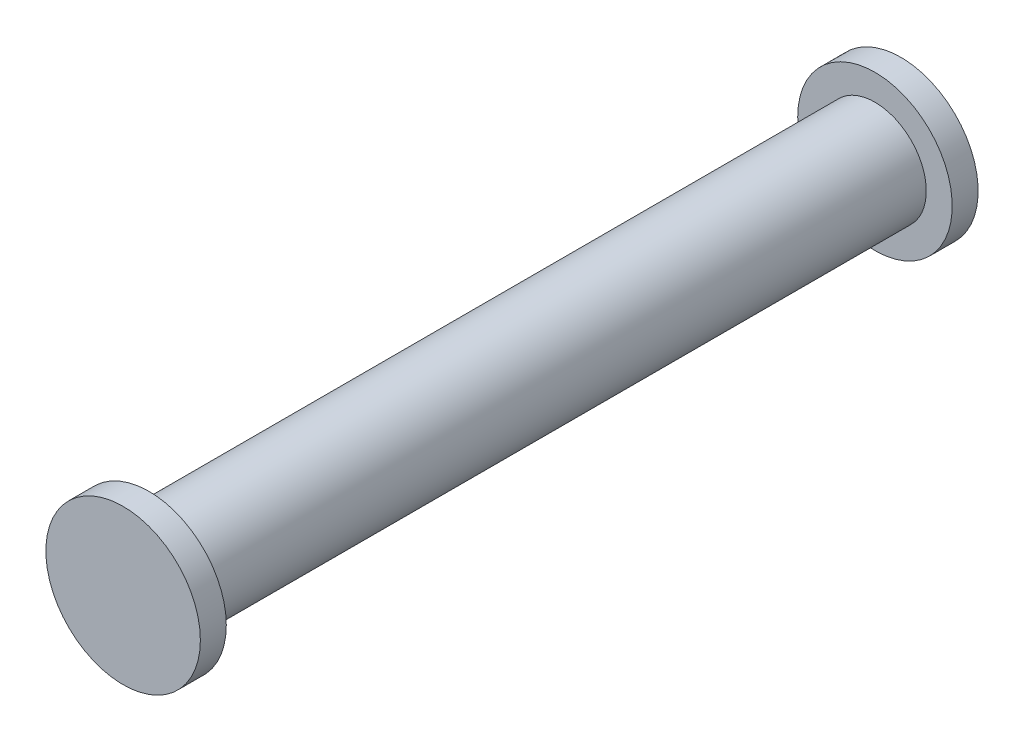
ISO-10303-21;
HEADER;
FILE_DESCRIPTION(('STEP AP214'),'2;1');
FILE_NAME('part.step','',(''),(''),'','','');
FILE_SCHEMA(('AUTOMOTIVE_DESIGN { 1 0 10303 214 1 1 1 1 }'));
ENDSEC;
DATA;
#1=APPLICATION_CONTEXT('core data for automotive mechanical design processes');
#2=APPLICATION_PROTOCOL_DEFINITION('international standard','automotive_design',2000,#1);
#3=PRODUCT_CONTEXT('',#1,'mechanical');
#4=PRODUCT('Part','Part','',(#3));
#5=PRODUCT_RELATED_PRODUCT_CATEGORY('part','',(#4));
#6=PRODUCT_DEFINITION_FORMATION('','',#4);
#7=PRODUCT_DEFINITION_CONTEXT('part definition',#1,'design');
#8=PRODUCT_DEFINITION('design','',#6,#7);
#9=PRODUCT_DEFINITION_SHAPE('','',#8);
#10=(LENGTH_UNIT() NAMED_UNIT(*) SI_UNIT(.MILLI.,.METRE.));
#11=(NAMED_UNIT(*) PLANE_ANGLE_UNIT() SI_UNIT($,.RADIAN.));
#12=(NAMED_UNIT(*) SI_UNIT($,.STERADIAN.) SOLID_ANGLE_UNIT());
#13=UNCERTAINTY_MEASURE_WITH_UNIT(LENGTH_MEASURE(1.E-05),#10,'distance_accuracy_value','');
#14=(GEOMETRIC_REPRESENTATION_CONTEXT(3) GLOBAL_UNCERTAINTY_ASSIGNED_CONTEXT((#13)) GLOBAL_UNIT_ASSIGNED_CONTEXT((#10,
#11,#12)) REPRESENTATION_CONTEXT('',''));
#15=CARTESIAN_POINT('',(0.,0.,0.));
#16=DIRECTION('',(0.,0.,1.));
#17=DIRECTION('',(1.,0.,0.));
#18=AXIS2_PLACEMENT_3D('',#15,#16,#17);
#19=CARTESIAN_POINT('',(0.,0.,70.));
#20=DIRECTION('',(0.,0.,-1.));
#21=DIRECTION('',(-1.,0.,0.));
#22=AXIS2_PLACEMENT_3D('',#19,#20,#21);
#23=CYLINDRICAL_SURFACE('',#22,4.95);
#24=CARTESIAN_POINT('',(0.,0.,70.));
#25=DIRECTION('',(0.,0.,1.));
#26=DIRECTION('',(1.,0.,0.));
#27=AXIS2_PLACEMENT_3D('',#24,#25,#26);
#28=CIRCLE('',#27,4.95);
#29=CARTESIAN_POINT('',(4.95,0.,70.));
#30=VERTEX_POINT('',#29);
#31=EDGE_CURVE('E10',#30,#30,#28,.T.);
#32=ORIENTED_EDGE('',*,*,#31,.F.);
#33=EDGE_LOOP('',(#32));
#34=FACE_BOUND('',#33,.T.);
#35=CARTESIAN_POINT('',(0.,0.,0.));
#36=DIRECTION('',(0.,0.,-1.));
#37=DIRECTION('',(-1.,0.,0.));
#38=AXIS2_PLACEMENT_3D('',#35,#36,#37);
#39=CIRCLE('',#38,4.95);
#40=CARTESIAN_POINT('',(-4.95,0.,0.));
#41=VERTEX_POINT('',#40);
#42=EDGE_CURVE('E43',#41,#41,#39,.T.);
#43=ORIENTED_EDGE('',*,*,#42,.F.);
#44=EDGE_LOOP('',(#43));
#45=FACE_BOUND('',#44,.T.);
#46=ADVANCED_FACE('F36',(#34,#45),#23,.T.);
#47=CARTESIAN_POINT('',(0.,0.,-2.5));
#48=DIRECTION('',(0.,0.,1.));
#49=DIRECTION('',(1.,0.,0.));
#50=AXIS2_PLACEMENT_3D('',#47,#48,#49);
#51=CYLINDRICAL_SURFACE('',#50,7.45);
#52=CARTESIAN_POINT('',(0.,0.,-2.5));
#53=DIRECTION('',(0.,0.,-1.));
#54=DIRECTION('',(-1.,0.,0.));
#55=AXIS2_PLACEMENT_3D('',#52,#53,#54);
#56=CIRCLE('',#55,7.45);
#57=CARTESIAN_POINT('',(-7.45,0.,-2.5));
#58=VERTEX_POINT('',#57);
#59=EDGE_CURVE('E49',#58,#58,#56,.T.);
#60=ORIENTED_EDGE('',*,*,#59,.F.);
#61=EDGE_LOOP('',(#60));
#62=FACE_BOUND('',#61,.T.);
#63=CARTESIAN_POINT('',(0.,0.,0.));
#64=DIRECTION('',(0.,0.,-1.));
#65=DIRECTION('',(-1.,0.,0.));
#66=AXIS2_PLACEMENT_3D('',#63,#64,#65);
#67=CIRCLE('',#66,7.45);
#68=CARTESIAN_POINT('',(-7.45,0.,0.));
#69=VERTEX_POINT('',#68);
#70=EDGE_CURVE('E55',#69,#69,#67,.T.);
#71=ORIENTED_EDGE('',*,*,#70,.T.);
#72=EDGE_LOOP('',(#71));
#73=FACE_BOUND('',#72,.T.);
#74=ADVANCED_FACE('F88',(#62,#73),#51,.T.);
#75=CARTESIAN_POINT('',(0.,0.,-2.5));
#76=DIRECTION('',(0.,0.,-1.));
#77=DIRECTION('',(-1.,0.,0.));
#78=AXIS2_PLACEMENT_3D('',#75,#76,#77);
#79=PLANE('',#78);
#80=ORIENTED_EDGE('',*,*,#59,.T.);
#81=EDGE_LOOP('',(#80));
#82=FACE_BOUND('',#81,.T.);
#83=ADVANCED_FACE('F93',(#82),#79,.T.);
#84=CARTESIAN_POINT('',(0.,0.,0.));
#85=DIRECTION('',(0.,0.,-1.));
#86=DIRECTION('',(-1.,0.,0.));
#87=AXIS2_PLACEMENT_3D('',#84,#85,#86);
#88=PLANE('',#87);
#89=ORIENTED_EDGE('',*,*,#42,.T.);
#90=EDGE_LOOP('',(#89));
#91=FACE_BOUND('',#90,.T.);
#92=ORIENTED_EDGE('',*,*,#70,.F.);
#93=EDGE_LOOP('',(#92));
#94=FACE_BOUND('',#93,.T.);
#95=ADVANCED_FACE('F76',(#91,#94),#88,.F.);
#96=CARTESIAN_POINT('',(0.,0.,72.5));
#97=DIRECTION('',(0.,0.,-1.));
#98=DIRECTION('',(-1.,0.,0.));
#99=AXIS2_PLACEMENT_3D('',#96,#97,#98);
#100=CYLINDRICAL_SURFACE('',#99,7.45);
#101=CARTESIAN_POINT('',(0.,0.,72.5));
#102=DIRECTION('',(0.,0.,1.));
#103=DIRECTION('',(1.,0.,0.));
#104=AXIS2_PLACEMENT_3D('',#101,#102,#103);
#105=CIRCLE('',#104,7.45);
#106=CARTESIAN_POINT('',(7.45,0.,72.5));
#107=VERTEX_POINT('',#106);
#108=EDGE_CURVE('E60',#107,#107,#105,.T.);
#109=ORIENTED_EDGE('',*,*,#108,.F.);
#110=EDGE_LOOP('',(#109));
#111=FACE_BOUND('',#110,.T.);
#112=CARTESIAN_POINT('',(0.,0.,70.));
#113=DIRECTION('',(0.,0.,1.));
#114=DIRECTION('',(1.,0.,0.));
#115=AXIS2_PLACEMENT_3D('',#112,#113,#114);
#116=CIRCLE('',#115,7.45);
#117=CARTESIAN_POINT('',(7.45,0.,70.));
#118=VERTEX_POINT('',#117);
#119=EDGE_CURVE('E62',#118,#118,#116,.T.);
#120=ORIENTED_EDGE('',*,*,#119,.T.);
#121=EDGE_LOOP('',(#120));
#122=FACE_BOUND('',#121,.T.);
#123=ADVANCED_FACE('F73',(#111,#122),#100,.T.);
#124=CARTESIAN_POINT('',(0.,0.,72.5));
#125=DIRECTION('',(0.,0.,1.));
#126=DIRECTION('',(1.,0.,0.));
#127=AXIS2_PLACEMENT_3D('',#124,#125,#126);
#128=PLANE('',#127);
#129=ORIENTED_EDGE('',*,*,#108,.T.);
#130=EDGE_LOOP('',(#129));
#131=FACE_BOUND('',#130,.T.);
#132=ADVANCED_FACE('F71',(#131),#128,.T.);
#133=CARTESIAN_POINT('',(0.,0.,70.));
#134=DIRECTION('',(0.,0.,1.));
#135=DIRECTION('',(1.,0.,0.));
#136=AXIS2_PLACEMENT_3D('',#133,#134,#135);
#137=PLANE('',#136);
#138=ORIENTED_EDGE('',*,*,#31,.T.);
#139=EDGE_LOOP('',(#138));
#140=FACE_BOUND('',#139,.T.);
#141=ORIENTED_EDGE('',*,*,#119,.F.);
#142=EDGE_LOOP('',(#141));
#143=FACE_BOUND('',#142,.T.);
#144=ADVANCED_FACE('F80',(#140,#143),#137,.F.);
#145=CLOSED_SHELL('',(#46,#74,#83,#95,#123,#132,#144));
#146=MANIFOLD_SOLID_BREP('B2',#145);
#147=ADVANCED_BREP_SHAPE_REPRESENTATION('',(#18,#146),#14);
#148=SHAPE_DEFINITION_REPRESENTATION(#9,#147);
ENDSEC;
END-ISO-10303-21;
